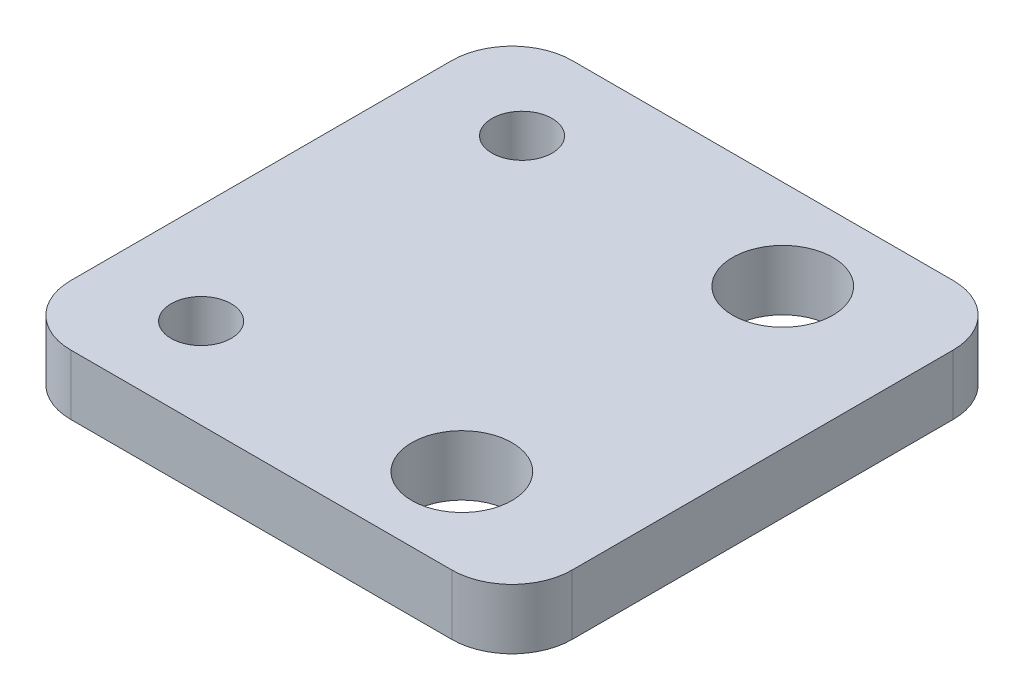
ISO-10303-21;
HEADER;
FILE_DESCRIPTION(('STEP AP214'),'2;1');
FILE_NAME('part.step','',(''),(''),'','','');
FILE_SCHEMA(('AUTOMOTIVE_DESIGN { 1 0 10303 214 1 1 1 1 }'));
ENDSEC;
DATA;
#1=APPLICATION_CONTEXT('core data for automotive mechanical design processes');
#2=APPLICATION_PROTOCOL_DEFINITION('international standard','automotive_design',2000,#1);
#3=PRODUCT_CONTEXT('',#1,'mechanical');
#4=PRODUCT('Part','Part','',(#3));
#5=PRODUCT_RELATED_PRODUCT_CATEGORY('part','',(#4));
#6=PRODUCT_DEFINITION_FORMATION('','',#4);
#7=PRODUCT_DEFINITION_CONTEXT('part definition',#1,'design');
#8=PRODUCT_DEFINITION('design','',#6,#7);
#9=PRODUCT_DEFINITION_SHAPE('','',#8);
#10=(LENGTH_UNIT() NAMED_UNIT(*) SI_UNIT(.MILLI.,.METRE.));
#11=(NAMED_UNIT(*) PLANE_ANGLE_UNIT() SI_UNIT($,.RADIAN.));
#12=(NAMED_UNIT(*) SI_UNIT($,.STERADIAN.) SOLID_ANGLE_UNIT());
#13=UNCERTAINTY_MEASURE_WITH_UNIT(LENGTH_MEASURE(1.E-05),#10,'distance_accuracy_value','');
#14=(GEOMETRIC_REPRESENTATION_CONTEXT(3) GLOBAL_UNCERTAINTY_ASSIGNED_CONTEXT((#13)) GLOBAL_UNIT_ASSIGNED_CONTEXT((#10,
#11,#12)) REPRESENTATION_CONTEXT('',''));
#15=CARTESIAN_POINT('',(0.,0.,0.));
#16=DIRECTION('',(0.,0.,1.));
#17=DIRECTION('',(1.,0.,0.));
#18=AXIS2_PLACEMENT_3D('',#15,#16,#17);
#19=CARTESIAN_POINT('',(-9.5,3.,-9.5));
#20=DIRECTION('',(0.,1.,0.));
#21=DIRECTION('',(0.,0.,1.));
#22=AXIS2_PLACEMENT_3D('',#19,#20,#21);
#23=PLANE('',#22);
#24=CARTESIAN_POINT('',(-7.5,3.,-8.));
#25=DIRECTION('',(0.,1.,0.));
#26=DIRECTION('',(0.,0.,1.));
#27=AXIS2_PLACEMENT_3D('',#24,#25,#26);
#28=CIRCLE('',#27,1.5);
#29=CARTESIAN_POINT('',(-7.5,3.,-6.5));
#30=VERTEX_POINT('',#29);
#31=EDGE_CURVE('E187',#30,#30,#28,.T.);
#32=ORIENTED_EDGE('',*,*,#31,.F.);
#33=EDGE_LOOP('',(#32));
#34=FACE_BOUND('',#33,.T.);
#35=CARTESIAN_POINT('',(5.5,3.,-8.));
#36=DIRECTION('',(0.,1.,0.));
#37=DIRECTION('',(0.,0.,1.));
#38=AXIS2_PLACEMENT_3D('',#35,#36,#37);
#39=CIRCLE('',#38,2.5);
#40=CARTESIAN_POINT('',(5.5,3.,-5.5));
#41=VERTEX_POINT('',#40);
#42=EDGE_CURVE('E133',#41,#41,#39,.T.);
#43=ORIENTED_EDGE('',*,*,#42,.F.);
#44=EDGE_LOOP('',(#43));
#45=FACE_BOUND('',#44,.T.);
#46=CARTESIAN_POINT('',(-9.5,3.,-9.5));
#47=DIRECTION('',(0.,1.,0.));
#48=DIRECTION('',(0.,0.,1.));
#49=AXIS2_PLACEMENT_3D('',#46,#47,#48);
#50=CIRCLE('',#49,3.);
#51=CARTESIAN_POINT('',(-9.5,3.,-12.5));
#52=VERTEX_POINT('',#51);
#53=CARTESIAN_POINT('',(-12.5,3.,-9.5));
#54=VERTEX_POINT('',#53);
#55=EDGE_CURVE('E144',#52,#54,#50,.T.);
#56=ORIENTED_EDGE('',*,*,#55,.T.);
#57=DIRECTION('',(0.,0.,1.));
#58=VECTOR('',#57,1.);
#59=CARTESIAN_POINT('',(-12.5,3.,-9.5));
#60=LINE('',#59,#58);
#61=CARTESIAN_POINT('',(-12.5,3.,9.5));
#62=VERTEX_POINT('',#61);
#63=EDGE_CURVE('E92',#54,#62,#60,.T.);
#64=ORIENTED_EDGE('',*,*,#63,.T.);
#65=CARTESIAN_POINT('',(-9.5,3.,9.5));
#66=DIRECTION('',(0.,1.,0.));
#67=DIRECTION('',(0.,0.,1.));
#68=AXIS2_PLACEMENT_3D('',#65,#66,#67);
#69=CIRCLE('',#68,3.);
#70=CARTESIAN_POINT('',(-9.5,3.,12.5));
#71=VERTEX_POINT('',#70);
#72=EDGE_CURVE('E159',#62,#71,#69,.T.);
#73=ORIENTED_EDGE('',*,*,#72,.T.);
#74=DIRECTION('',(1.,0.,0.));
#75=VECTOR('',#74,1.);
#76=CARTESIAN_POINT('',(-9.5,3.,12.5));
#77=LINE('',#76,#75);
#78=CARTESIAN_POINT('',(9.5,3.,12.5));
#79=VERTEX_POINT('',#78);
#80=EDGE_CURVE('E172',#71,#79,#77,.T.);
#81=ORIENTED_EDGE('',*,*,#80,.T.);
#82=CARTESIAN_POINT('',(9.5,3.,9.5));
#83=DIRECTION('',(0.,1.,0.));
#84=DIRECTION('',(0.,0.,1.));
#85=AXIS2_PLACEMENT_3D('',#82,#83,#84);
#86=CIRCLE('',#85,3.);
#87=CARTESIAN_POINT('',(12.5,3.,9.5));
#88=VERTEX_POINT('',#87);
#89=EDGE_CURVE('E111',#79,#88,#86,.T.);
#90=ORIENTED_EDGE('',*,*,#89,.T.);
#91=DIRECTION('',(0.,0.,-1.));
#92=VECTOR('',#91,1.);
#93=CARTESIAN_POINT('',(12.5,3.,-9.5));
#94=LINE('',#93,#92);
#95=CARTESIAN_POINT('',(12.5,3.,-9.5));
#96=VERTEX_POINT('',#95);
#97=EDGE_CURVE('E105',#88,#96,#94,.T.);
#98=ORIENTED_EDGE('',*,*,#97,.T.);
#99=CARTESIAN_POINT('',(9.5,3.,-9.5));
#100=DIRECTION('',(0.,1.,0.));
#101=DIRECTION('',(0.,0.,1.));
#102=AXIS2_PLACEMENT_3D('',#99,#100,#101);
#103=CIRCLE('',#102,3.);
#104=CARTESIAN_POINT('',(9.5,3.,-12.5));
#105=VERTEX_POINT('',#104);
#106=EDGE_CURVE('E109',#96,#105,#103,.T.);
#107=ORIENTED_EDGE('',*,*,#106,.T.);
#108=DIRECTION('',(-1.,0.,0.));
#109=VECTOR('',#108,1.);
#110=CARTESIAN_POINT('',(-9.5,3.,-12.5));
#111=LINE('',#110,#109);
#112=EDGE_CURVE('E49',#105,#52,#111,.T.);
#113=ORIENTED_EDGE('',*,*,#112,.T.);
#114=EDGE_LOOP('',(#56,#64,#73,#81,#90,#98,#107,#113));
#115=FACE_BOUND('',#114,.T.);
#116=CARTESIAN_POINT('',(5.5,3.,8.));
#117=DIRECTION('',(0.,1.,0.));
#118=DIRECTION('',(0.,0.,1.));
#119=AXIS2_PLACEMENT_3D('',#116,#117,#118);
#120=CIRCLE('',#119,2.5);
#121=CARTESIAN_POINT('',(5.5,3.,10.5));
#122=VERTEX_POINT('',#121);
#123=EDGE_CURVE('E181',#122,#122,#120,.T.);
#124=ORIENTED_EDGE('',*,*,#123,.F.);
#125=EDGE_LOOP('',(#124));
#126=FACE_BOUND('',#125,.T.);
#127=CARTESIAN_POINT('',(-7.5,3.,8.));
#128=DIRECTION('',(0.,1.,0.));
#129=DIRECTION('',(0.,0.,1.));
#130=AXIS2_PLACEMENT_3D('',#127,#128,#129);
#131=CIRCLE('',#130,1.5);
#132=CARTESIAN_POINT('',(-7.5,3.,9.5));
#133=VERTEX_POINT('',#132);
#134=EDGE_CURVE('E193',#133,#133,#131,.T.);
#135=ORIENTED_EDGE('',*,*,#134,.F.);
#136=EDGE_LOOP('',(#135));
#137=FACE_BOUND('',#136,.T.);
#138=ADVANCED_FACE('F32',(#34,#45,#115,#126,#137),#23,.T.);
#139=CARTESIAN_POINT('',(-9.5,0.,-9.5));
#140=DIRECTION('',(0.,1.,0.));
#141=DIRECTION('',(0.,0.,1.));
#142=AXIS2_PLACEMENT_3D('',#139,#140,#141);
#143=PLANE('',#142);
#144=CARTESIAN_POINT('',(-9.5,0.,-9.5));
#145=DIRECTION('',(0.,1.,0.));
#146=DIRECTION('',(0.,0.,1.));
#147=AXIS2_PLACEMENT_3D('',#144,#145,#146);
#148=CIRCLE('',#147,3.);
#149=CARTESIAN_POINT('',(-9.5,0.,-12.5));
#150=VERTEX_POINT('',#149);
#151=CARTESIAN_POINT('',(-12.5,0.,-9.5));
#152=VERTEX_POINT('',#151);
#153=EDGE_CURVE('E129',#150,#152,#148,.T.);
#154=ORIENTED_EDGE('',*,*,#153,.F.);
#155=DIRECTION('',(-1.,0.,0.));
#156=VECTOR('',#155,1.);
#157=CARTESIAN_POINT('',(-9.5,0.,-12.5));
#158=LINE('',#157,#156);
#159=CARTESIAN_POINT('',(9.5,0.,-12.5));
#160=VERTEX_POINT('',#159);
#161=EDGE_CURVE('E84',#160,#150,#158,.T.);
#162=ORIENTED_EDGE('',*,*,#161,.F.);
#163=CARTESIAN_POINT('',(9.5,0.,-9.5));
#164=DIRECTION('',(0.,1.,0.));
#165=DIRECTION('',(0.,0.,1.));
#166=AXIS2_PLACEMENT_3D('',#163,#164,#165);
#167=CIRCLE('',#166,3.);
#168=CARTESIAN_POINT('',(12.5,0.,-9.5));
#169=VERTEX_POINT('',#168);
#170=EDGE_CURVE('E78',#169,#160,#167,.T.);
#171=ORIENTED_EDGE('',*,*,#170,.F.);
#172=DIRECTION('',(0.,0.,-1.));
#173=VECTOR('',#172,1.);
#174=CARTESIAN_POINT('',(12.5,0.,-9.5));
#175=LINE('',#174,#173);
#176=CARTESIAN_POINT('',(12.5,0.,9.5));
#177=VERTEX_POINT('',#176);
#178=EDGE_CURVE('E119',#177,#169,#175,.T.);
#179=ORIENTED_EDGE('',*,*,#178,.F.);
#180=CARTESIAN_POINT('',(9.5,0.,9.5));
#181=DIRECTION('',(0.,1.,0.));
#182=DIRECTION('',(0.,0.,1.));
#183=AXIS2_PLACEMENT_3D('',#180,#181,#182);
#184=CIRCLE('',#183,3.);
#185=CARTESIAN_POINT('',(9.5,0.,12.5));
#186=VERTEX_POINT('',#185);
#187=EDGE_CURVE('E139',#186,#177,#184,.T.);
#188=ORIENTED_EDGE('',*,*,#187,.F.);
#189=DIRECTION('',(1.,0.,0.));
#190=VECTOR('',#189,1.);
#191=CARTESIAN_POINT('',(-9.5,0.,12.5));
#192=LINE('',#191,#190);
#193=CARTESIAN_POINT('',(-9.5,0.,12.5));
#194=VERTEX_POINT('',#193);
#195=EDGE_CURVE('E137',#194,#186,#192,.T.);
#196=ORIENTED_EDGE('',*,*,#195,.F.);
#197=CARTESIAN_POINT('',(-9.5,0.,9.5));
#198=DIRECTION('',(0.,1.,0.));
#199=DIRECTION('',(0.,0.,1.));
#200=AXIS2_PLACEMENT_3D('',#197,#198,#199);
#201=CIRCLE('',#200,3.);
#202=CARTESIAN_POINT('',(-12.5,0.,9.5));
#203=VERTEX_POINT('',#202);
#204=EDGE_CURVE('E135',#203,#194,#201,.T.);
#205=ORIENTED_EDGE('',*,*,#204,.F.);
#206=DIRECTION('',(0.,0.,1.));
#207=VECTOR('',#206,1.);
#208=CARTESIAN_POINT('',(-12.5,0.,-9.5));
#209=LINE('',#208,#207);
#210=EDGE_CURVE('E132',#152,#203,#209,.T.);
#211=ORIENTED_EDGE('',*,*,#210,.F.);
#212=EDGE_LOOP('',(#154,#162,#171,#179,#188,#196,#205,#211));
#213=FACE_BOUND('',#212,.T.);
#214=CARTESIAN_POINT('',(5.5,0.,-8.));
#215=DIRECTION('',(0.,1.,0.));
#216=DIRECTION('',(0.,0.,1.));
#217=AXIS2_PLACEMENT_3D('',#214,#215,#216);
#218=CIRCLE('',#217,2.5);
#219=CARTESIAN_POINT('',(5.5,0.,-5.5));
#220=VERTEX_POINT('',#219);
#221=EDGE_CURVE('E178',#220,#220,#218,.T.);
#222=ORIENTED_EDGE('',*,*,#221,.T.);
#223=EDGE_LOOP('',(#222));
#224=FACE_BOUND('',#223,.T.);
#225=CARTESIAN_POINT('',(5.5,0.,8.));
#226=DIRECTION('',(0.,1.,0.));
#227=DIRECTION('',(0.,0.,1.));
#228=AXIS2_PLACEMENT_3D('',#225,#226,#227);
#229=CIRCLE('',#228,2.5);
#230=CARTESIAN_POINT('',(5.5,0.,10.5));
#231=VERTEX_POINT('',#230);
#232=EDGE_CURVE('E184',#231,#231,#229,.T.);
#233=ORIENTED_EDGE('',*,*,#232,.T.);
#234=EDGE_LOOP('',(#233));
#235=FACE_BOUND('',#234,.T.);
#236=CARTESIAN_POINT('',(-7.5,0.,-8.));
#237=DIRECTION('',(0.,1.,0.));
#238=DIRECTION('',(0.,0.,1.));
#239=AXIS2_PLACEMENT_3D('',#236,#237,#238);
#240=CIRCLE('',#239,1.5);
#241=CARTESIAN_POINT('',(-7.5,0.,-6.5));
#242=VERTEX_POINT('',#241);
#243=EDGE_CURVE('E190',#242,#242,#240,.T.);
#244=ORIENTED_EDGE('',*,*,#243,.T.);
#245=EDGE_LOOP('',(#244));
#246=FACE_BOUND('',#245,.T.);
#247=CARTESIAN_POINT('',(-7.5,0.,8.));
#248=DIRECTION('',(0.,1.,0.));
#249=DIRECTION('',(0.,0.,1.));
#250=AXIS2_PLACEMENT_3D('',#247,#248,#249);
#251=CIRCLE('',#250,1.5);
#252=CARTESIAN_POINT('',(-7.5,0.,9.5));
#253=VERTEX_POINT('',#252);
#254=EDGE_CURVE('E196',#253,#253,#251,.T.);
#255=ORIENTED_EDGE('',*,*,#254,.T.);
#256=EDGE_LOOP('',(#255));
#257=FACE_BOUND('',#256,.T.);
#258=ADVANCED_FACE('F163',(#213,#224,#235,#246,#257),#143,.F.);
#259=CARTESIAN_POINT('',(-9.5,3.,-9.5));
#260=DIRECTION('',(0.,-1.,0.));
#261=DIRECTION('',(0.,0.,-1.));
#262=AXIS2_PLACEMENT_3D('',#259,#260,#261);
#263=CYLINDRICAL_SURFACE('',#262,3.);
#264=ORIENTED_EDGE('',*,*,#153,.T.);
#265=DIRECTION('',(0.,-1.,0.));
#266=VECTOR('',#265,1.);
#267=CARTESIAN_POINT('',(-12.5,3.,-9.5));
#268=LINE('',#267,#266);
#269=EDGE_CURVE('E11',#54,#152,#268,.T.);
#270=ORIENTED_EDGE('',*,*,#269,.F.);
#271=ORIENTED_EDGE('',*,*,#55,.F.);
#272=DIRECTION('',(0.,-1.,0.));
#273=VECTOR('',#272,1.);
#274=CARTESIAN_POINT('',(-9.5,3.,-12.5));
#275=LINE('',#274,#273);
#276=EDGE_CURVE('E125',#52,#150,#275,.T.);
#277=ORIENTED_EDGE('',*,*,#276,.T.);
#278=EDGE_LOOP('',(#264,#270,#271,#277));
#279=FACE_BOUND('',#278,.T.);
#280=ADVANCED_FACE('F34',(#279),#263,.T.);
#281=CARTESIAN_POINT('',(-12.5,3.,-9.5));
#282=DIRECTION('',(1.,0.,0.));
#283=DIRECTION('',(0.,0.,-1.));
#284=AXIS2_PLACEMENT_3D('',#281,#282,#283);
#285=PLANE('',#284);
#286=ORIENTED_EDGE('',*,*,#210,.T.);
#287=DIRECTION('',(0.,-1.,0.));
#288=VECTOR('',#287,1.);
#289=CARTESIAN_POINT('',(-12.5,3.,9.5));
#290=LINE('',#289,#288);
#291=EDGE_CURVE('E41',#62,#203,#290,.T.);
#292=ORIENTED_EDGE('',*,*,#291,.F.);
#293=ORIENTED_EDGE('',*,*,#63,.F.);
#294=ORIENTED_EDGE('',*,*,#269,.T.);
#295=EDGE_LOOP('',(#286,#292,#293,#294));
#296=FACE_BOUND('',#295,.T.);
#297=ADVANCED_FACE('F230',(#296),#285,.F.);
#298=CARTESIAN_POINT('',(-9.5,3.,9.5));
#299=DIRECTION('',(0.,-1.,0.));
#300=DIRECTION('',(0.,0.,-1.));
#301=AXIS2_PLACEMENT_3D('',#298,#299,#300);
#302=CYLINDRICAL_SURFACE('',#301,3.);
#303=ORIENTED_EDGE('',*,*,#204,.T.);
#304=DIRECTION('',(0.,-1.,0.));
#305=VECTOR('',#304,1.);
#306=CARTESIAN_POINT('',(-9.5,3.,12.5));
#307=LINE('',#306,#305);
#308=EDGE_CURVE('E151',#71,#194,#307,.T.);
#309=ORIENTED_EDGE('',*,*,#308,.F.);
#310=ORIENTED_EDGE('',*,*,#72,.F.);
#311=ORIENTED_EDGE('',*,*,#291,.T.);
#312=EDGE_LOOP('',(#303,#309,#310,#311));
#313=FACE_BOUND('',#312,.T.);
#314=ADVANCED_FACE('F157',(#313),#302,.T.);
#315=CARTESIAN_POINT('',(-9.5,3.,12.5));
#316=DIRECTION('',(0.,0.,-1.));
#317=DIRECTION('',(-1.,0.,0.));
#318=AXIS2_PLACEMENT_3D('',#315,#316,#317);
#319=PLANE('',#318);
#320=ORIENTED_EDGE('',*,*,#195,.T.);
#321=DIRECTION('',(0.,-1.,0.));
#322=VECTOR('',#321,1.);
#323=CARTESIAN_POINT('',(9.5,3.,12.5));
#324=LINE('',#323,#322);
#325=EDGE_CURVE('E148',#79,#186,#324,.T.);
#326=ORIENTED_EDGE('',*,*,#325,.F.);
#327=ORIENTED_EDGE('',*,*,#80,.F.);
#328=ORIENTED_EDGE('',*,*,#308,.T.);
#329=EDGE_LOOP('',(#320,#326,#327,#328));
#330=FACE_BOUND('',#329,.T.);
#331=ADVANCED_FACE('F168',(#330),#319,.F.);
#332=CARTESIAN_POINT('',(9.5,3.,9.5));
#333=DIRECTION('',(0.,-1.,0.));
#334=DIRECTION('',(0.,0.,-1.));
#335=AXIS2_PLACEMENT_3D('',#332,#333,#334);
#336=CYLINDRICAL_SURFACE('',#335,3.);
#337=ORIENTED_EDGE('',*,*,#187,.T.);
#338=DIRECTION('',(0.,-1.,0.));
#339=VECTOR('',#338,1.);
#340=CARTESIAN_POINT('',(12.5,3.,9.5));
#341=LINE('',#340,#339);
#342=EDGE_CURVE('E120',#88,#177,#341,.T.);
#343=ORIENTED_EDGE('',*,*,#342,.F.);
#344=ORIENTED_EDGE('',*,*,#89,.F.);
#345=ORIENTED_EDGE('',*,*,#325,.T.);
#346=EDGE_LOOP('',(#337,#343,#344,#345));
#347=FACE_BOUND('',#346,.T.);
#348=ADVANCED_FACE('F171',(#347),#336,.T.);
#349=CARTESIAN_POINT('',(12.5,3.,-9.5));
#350=DIRECTION('',(-1.,0.,0.));
#351=DIRECTION('',(0.,0.,1.));
#352=AXIS2_PLACEMENT_3D('',#349,#350,#351);
#353=PLANE('',#352);
#354=ORIENTED_EDGE('',*,*,#178,.T.);
#355=DIRECTION('',(0.,-1.,0.));
#356=VECTOR('',#355,1.);
#357=CARTESIAN_POINT('',(12.5,3.,-9.5));
#358=LINE('',#357,#356);
#359=EDGE_CURVE('E116',#96,#169,#358,.T.);
#360=ORIENTED_EDGE('',*,*,#359,.F.);
#361=ORIENTED_EDGE('',*,*,#97,.F.);
#362=ORIENTED_EDGE('',*,*,#342,.T.);
#363=EDGE_LOOP('',(#354,#360,#361,#362));
#364=FACE_BOUND('',#363,.T.);
#365=ADVANCED_FACE('F117',(#364),#353,.F.);
#366=CARTESIAN_POINT('',(9.5,3.,-9.5));
#367=DIRECTION('',(0.,-1.,0.));
#368=DIRECTION('',(0.,0.,-1.));
#369=AXIS2_PLACEMENT_3D('',#366,#367,#368);
#370=CYLINDRICAL_SURFACE('',#369,3.);
#371=ORIENTED_EDGE('',*,*,#170,.T.);
#372=DIRECTION('',(0.,-1.,0.));
#373=VECTOR('',#372,1.);
#374=CARTESIAN_POINT('',(9.5,3.,-12.5));
#375=LINE('',#374,#373);
#376=EDGE_CURVE('E121',#105,#160,#375,.T.);
#377=ORIENTED_EDGE('',*,*,#376,.F.);
#378=ORIENTED_EDGE('',*,*,#106,.F.);
#379=ORIENTED_EDGE('',*,*,#359,.T.);
#380=EDGE_LOOP('',(#371,#377,#378,#379));
#381=FACE_BOUND('',#380,.T.);
#382=ADVANCED_FACE('F123',(#381),#370,.T.);
#383=CARTESIAN_POINT('',(-9.5,3.,-12.5));
#384=DIRECTION('',(0.,0.,1.));
#385=DIRECTION('',(1.,0.,0.));
#386=AXIS2_PLACEMENT_3D('',#383,#384,#385);
#387=PLANE('',#386);
#388=ORIENTED_EDGE('',*,*,#161,.T.);
#389=ORIENTED_EDGE('',*,*,#276,.F.);
#390=ORIENTED_EDGE('',*,*,#112,.F.);
#391=ORIENTED_EDGE('',*,*,#376,.T.);
#392=EDGE_LOOP('',(#388,#389,#390,#391));
#393=FACE_BOUND('',#392,.T.);
#394=ADVANCED_FACE('F218',(#393),#387,.F.);
#395=CARTESIAN_POINT('',(5.5,3.,-8.));
#396=DIRECTION('',(0.,-1.,0.));
#397=DIRECTION('',(0.,0.,-1.));
#398=AXIS2_PLACEMENT_3D('',#395,#396,#397);
#399=CYLINDRICAL_SURFACE('',#398,2.5);
#400=ORIENTED_EDGE('',*,*,#42,.T.);
#401=EDGE_LOOP('',(#400));
#402=FACE_BOUND('',#401,.T.);
#403=ORIENTED_EDGE('',*,*,#221,.F.);
#404=EDGE_LOOP('',(#403));
#405=FACE_BOUND('',#404,.T.);
#406=ADVANCED_FACE('F215',(#402,#405),#399,.F.);
#407=CARTESIAN_POINT('',(5.5,3.,8.));
#408=DIRECTION('',(0.,-1.,0.));
#409=DIRECTION('',(0.,0.,-1.));
#410=AXIS2_PLACEMENT_3D('',#407,#408,#409);
#411=CYLINDRICAL_SURFACE('',#410,2.5);
#412=ORIENTED_EDGE('',*,*,#123,.T.);
#413=EDGE_LOOP('',(#412));
#414=FACE_BOUND('',#413,.T.);
#415=ORIENTED_EDGE('',*,*,#232,.F.);
#416=EDGE_LOOP('',(#415));
#417=FACE_BOUND('',#416,.T.);
#418=ADVANCED_FACE('F294',(#414,#417),#411,.F.);
#419=CARTESIAN_POINT('',(-7.5,3.,-8.));
#420=DIRECTION('',(0.,-1.,0.));
#421=DIRECTION('',(0.,0.,-1.));
#422=AXIS2_PLACEMENT_3D('',#419,#420,#421);
#423=CYLINDRICAL_SURFACE('',#422,1.5);
#424=ORIENTED_EDGE('',*,*,#31,.T.);
#425=EDGE_LOOP('',(#424));
#426=FACE_BOUND('',#425,.T.);
#427=ORIENTED_EDGE('',*,*,#243,.F.);
#428=EDGE_LOOP('',(#427));
#429=FACE_BOUND('',#428,.T.);
#430=ADVANCED_FACE('F302',(#426,#429),#423,.F.);
#431=CARTESIAN_POINT('',(-7.5,3.,8.));
#432=DIRECTION('',(0.,-1.,0.));
#433=DIRECTION('',(0.,0.,-1.));
#434=AXIS2_PLACEMENT_3D('',#431,#432,#433);
#435=CYLINDRICAL_SURFACE('',#434,1.5);
#436=ORIENTED_EDGE('',*,*,#134,.T.);
#437=EDGE_LOOP('',(#436));
#438=FACE_BOUND('',#437,.T.);
#439=ORIENTED_EDGE('',*,*,#254,.F.);
#440=EDGE_LOOP('',(#439));
#441=FACE_BOUND('',#440,.T.);
#442=ADVANCED_FACE('F202',(#438,#441),#435,.F.);
#443=CLOSED_SHELL('',(#138,#258,#280,#297,#314,#331,#348,#365,#382,#394,#406,#418,#430,#442));
#444=MANIFOLD_SOLID_BREP('B2',#443);
#445=ADVANCED_BREP_SHAPE_REPRESENTATION('',(#18,#444),#14);
#446=SHAPE_DEFINITION_REPRESENTATION(#9,#445);
ENDSEC;
END-ISO-10303-21;
